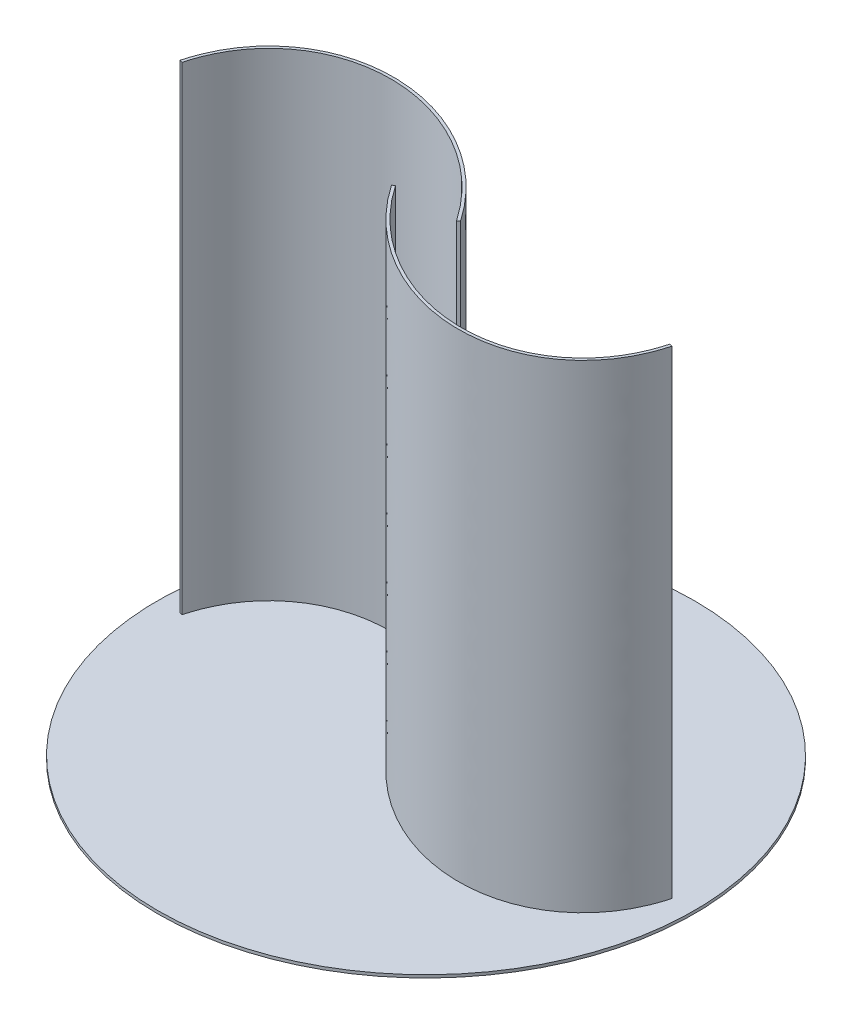
ISO-10303-21;
HEADER;
FILE_DESCRIPTION(('STEP AP214'),'2;1');
FILE_NAME('part.step','',(''),(''),'','','');
FILE_SCHEMA(('AUTOMOTIVE_DESIGN { 1 0 10303 214 1 1 1 1 }'));
ENDSEC;
DATA;
#1=APPLICATION_CONTEXT('core data for automotive mechanical design processes');
#2=APPLICATION_PROTOCOL_DEFINITION('international standard','automotive_design',2000,#1);
#3=PRODUCT_CONTEXT('',#1,'mechanical');
#4=PRODUCT('Part','Part','',(#3));
#5=PRODUCT_RELATED_PRODUCT_CATEGORY('part','',(#4));
#6=PRODUCT_DEFINITION_FORMATION('','',#4);
#7=PRODUCT_DEFINITION_CONTEXT('part definition',#1,'design');
#8=PRODUCT_DEFINITION('design','',#6,#7);
#9=PRODUCT_DEFINITION_SHAPE('','',#8);
#10=(LENGTH_UNIT() NAMED_UNIT(*) SI_UNIT(.MILLI.,.METRE.));
#11=(NAMED_UNIT(*) PLANE_ANGLE_UNIT() SI_UNIT($,.RADIAN.));
#12=(NAMED_UNIT(*) SI_UNIT($,.STERADIAN.) SOLID_ANGLE_UNIT());
#13=UNCERTAINTY_MEASURE_WITH_UNIT(LENGTH_MEASURE(1.E-05),#10,'distance_accuracy_value','');
#14=(GEOMETRIC_REPRESENTATION_CONTEXT(3) GLOBAL_UNCERTAINTY_ASSIGNED_CONTEXT((#13)) GLOBAL_UNIT_ASSIGNED_CONTEXT((#10,
#11,#12)) REPRESENTATION_CONTEXT('',''));
#15=CARTESIAN_POINT('',(0.,0.,0.));
#16=DIRECTION('',(0.,0.,1.));
#17=DIRECTION('',(1.,0.,0.));
#18=AXIS2_PLACEMENT_3D('',#15,#16,#17);
#19=CARTESIAN_POINT('',(0.,0.,0.));
#20=DIRECTION('',(0.,-1.,0.));
#21=DIRECTION('',(0.,0.,-1.));
#22=AXIS2_PLACEMENT_3D('',#19,#20,#21);
#23=PLANE('',#22);
#24=CARTESIAN_POINT('',(0.,0.,0.));
#25=DIRECTION('',(0.,-1.,0.));
#26=DIRECTION('',(0.,0.,-1.));
#27=AXIS2_PLACEMENT_3D('',#24,#25,#26);
#28=CIRCLE('',#27,280.5);
#29=CARTESIAN_POINT('',(0.,0.,-280.5));
#30=VERTEX_POINT('',#29);
#31=EDGE_CURVE('E167',#30,#30,#28,.T.);
#32=ORIENTED_EDGE('',*,*,#31,.F.);
#33=EDGE_LOOP('',(#32));
#34=FACE_BOUND('',#33,.T.);
#35=CARTESIAN_POINT('',(34.3567019278323,0.,-1.68557276360102));
#36=CARTESIAN_POINT('',(29.5180406320266,0.,-8.80962894511758));
#37=CARTESIAN_POINT('',(24.2678238614142,0.,-15.6854511547654));
#38=CARTESIAN_POINT('',(13.043122074148,0.,-28.8115258866319));
#39=CARTESIAN_POINT('',(7.06870096124442,0.,-35.0617037097251));
#40=CARTESIAN_POINT('',(-5.49220739244214,0.,-46.8186660185623));
#41=CARTESIAN_POINT('',(-12.0786234161373,0.,-52.3253840881677));
#42=CARTESIAN_POINT('',(-25.7401042447688,0.,-62.4911675497407));
#43=CARTESIAN_POINT('',(-32.8150929712779,0.,-67.1501762714525));
#44=CARTESIAN_POINT('',(-47.3213062086278,0.,-75.5316972747135));
#45=CARTESIAN_POINT('',(-54.7524526929741,0.,-79.2541631386594));
#46=CARTESIAN_POINT('',(-69.8318961120836,0.,-85.6907173548556));
#47=CARTESIAN_POINT('',(-77.4801160580006,0.,-88.4047685955086));
#48=CARTESIAN_POINT('',(-92.8502852906042,0.,-92.7708226575345));
#49=CARTESIAN_POINT('',(-100.572160633638,0.,-94.42279479753));
#50=CARTESIAN_POINT('',(-115.944153652561,0.,-96.63023356898));
#51=CARTESIAN_POINT('',(-123.594199427155,0.,-97.1856714771729));
#52=CARTESIAN_POINT('',(-138.677159660124,0.,-97.1856714771729));
#53=CARTESIAN_POINT('',(-146.10999788381,0.,-96.6302033707519));
#54=CARTESIAN_POINT('',(-160.615473740591,0.,-94.4149822007725));
#55=CARTESIAN_POINT('',(-167.688019400796,0.,-92.7552008752739));
#56=CARTESIAN_POINT('',(-181.334621666947,0.,-88.3598064115517));
#57=CARTESIAN_POINT('',(-187.908561767561,0.,-85.6241825860824));
#58=CARTESIAN_POINT('',(-200.427548629182,0.,-79.1280760902114));
#59=CARTESIAN_POINT('',(-206.372461713424,0.,-75.3676234577438));
#60=CARTESIAN_POINT('',(-217.51467821894,0.,-66.8951501946636));
#61=CARTESIAN_POINT('',(-222.71185880741,0.,-62.1832120282308));
#62=CARTESIAN_POINT('',(-232.255552380654,0.,-51.9017106473851));
#63=CARTESIAN_POINT('',(-236.601983990372,0.,-46.3322670491086));
#64=CARTESIAN_POINT('',(-244.359948454659,0.,-34.4472337790854));
#65=CARTESIAN_POINT('',(-247.77144985236,0.,-28.1317689769799));
#66=CARTESIAN_POINT('',(-253.595847097703,0.,-14.8799160218172));
#67=CARTESIAN_POINT('',(-256.008745547293,0.,-7.94363520686398));
#68=CARTESIAN_POINT('',(-257.900928695948,0.,-0.764599699857649));
#69=B_SPLINE_CURVE_WITH_KNOTS('',3,(#35,#36,#37,#38,#39,#40,#41,#42,#43,#44,#45,#46,#47,#48,#49,
#50,#51,#52,#53,#54,#55,#56,#57,#58,#59,#60,#61,#62,#63,#64,#65,#66,#67,#68),.UNSPECIFIED.,.F.,
.F.,(4,2,2,2,2,2,2,2,2,2,2,2,2,2,2,2,4),(0.,0.0625,0.125,0.1875,0.25,0.3125,0.375,0.4375,0.5,
0.5625,0.625,0.6875,0.75,0.8125,0.875,0.9375,1.),.UNSPECIFIED.);
#70=CARTESIAN_POINT('',(34.3567019278323,0.,-1.68557276360102));
#71=VERTEX_POINT('',#70);
#72=CARTESIAN_POINT('',(-257.900928695948,0.,-0.764599699857649));
#73=VERTEX_POINT('',#72);
#74=EDGE_CURVE('E221',#71,#73,#69,.T.);
#75=ORIENTED_EDGE('',*,*,#74,.F.);
#76=DIRECTION('',(-0.827233975944077,0.,0.561857587867028));
#77=VECTOR('',#76,1.);
#78=CARTESIAN_POINT('',(34.3567019278323,0.,-1.68557276360102));
#79=LINE('',#78,#77);
#80=CARTESIAN_POINT('',(31.8750000000001,0.,0.));
#81=VERTEX_POINT('',#80);
#82=EDGE_CURVE('E235',#71,#81,#79,.T.);
#83=ORIENTED_EDGE('',*,*,#82,.T.);
#84=CARTESIAN_POINT('',(-95.6588797749406,0.,76.5278398675861));
#85=DIRECTION('',(0.,1.,0.));
#86=DIRECTION('',(-0.642787609686538,0.,-0.766044443118979));
#87=AXIS2_PLACEMENT_3D('',#84,#85,#86);
#88=ELLIPSE('',#87,185.,148.072291028999);
#89=CARTESIAN_POINT('',(-255.,0.,0.));
#90=VERTEX_POINT('',#89);
#91=EDGE_CURVE('E232',#81,#90,#88,.T.);
#92=ORIENTED_EDGE('',*,*,#91,.T.);
#93=DIRECTION('',(-0.966976231982835,0.,-0.254866566619239));
#94=VECTOR('',#93,1.);
#95=CARTESIAN_POINT('',(-255.,0.,0.));
#96=LINE('',#95,#94);
#97=EDGE_CURVE('E225',#90,#73,#96,.T.);
#98=ORIENTED_EDGE('',*,*,#97,.T.);
#99=EDGE_LOOP('',(#75,#83,#92,#98));
#100=FACE_BOUND('',#99,.T.);
#101=CARTESIAN_POINT('',(-34.3567019278323,0.,1.68557276360107));
#102=CARTESIAN_POINT('',(-29.5180406320266,0.,8.80962894511763));
#103=CARTESIAN_POINT('',(-24.2678238614141,0.,15.6854511547655));
#104=CARTESIAN_POINT('',(-13.0431220741479,0.,28.811525886632));
#105=CARTESIAN_POINT('',(-7.06870096124435,0.,35.0617037097251));
#106=CARTESIAN_POINT('',(5.49220739244221,0.,46.8186660185623));
#107=CARTESIAN_POINT('',(12.0786234161373,0.,52.3253840881677));
#108=CARTESIAN_POINT('',(25.7401042447688,0.,62.4911675497407));
#109=CARTESIAN_POINT('',(32.8150929712779,0.,67.1501762714525));
#110=CARTESIAN_POINT('',(47.3213062086279,0.,75.5316972747135));
#111=CARTESIAN_POINT('',(54.7524526929742,0.,79.2541631386594));
#112=CARTESIAN_POINT('',(69.8318961120837,0.,85.6907173548555));
#113=CARTESIAN_POINT('',(77.4801160580007,0.,88.4047685955086));
#114=CARTESIAN_POINT('',(92.8502852906043,0.,92.7708226575345));
#115=CARTESIAN_POINT('',(100.572160633638,0.,94.4227947975299));
#116=CARTESIAN_POINT('',(115.944153652561,0.,96.63023356898));
#117=CARTESIAN_POINT('',(123.594199427155,0.,97.1856714771729));
#118=CARTESIAN_POINT('',(138.677159660125,0.,97.1856714771729));
#119=CARTESIAN_POINT('',(146.10999788381,0.,96.6302033707519));
#120=CARTESIAN_POINT('',(160.615473740591,0.,94.4149822007725));
#121=CARTESIAN_POINT('',(167.688019400796,0.,92.7552008752738));
#122=CARTESIAN_POINT('',(181.334621666947,0.,88.3598064115516));
#123=CARTESIAN_POINT('',(187.908561767561,0.,85.6241825860823));
#124=CARTESIAN_POINT('',(200.427548629183,0.,79.1280760902113));
#125=CARTESIAN_POINT('',(206.372461713424,0.,75.3676234577438));
#126=CARTESIAN_POINT('',(217.51467821894,0.,66.8951501946635));
#127=CARTESIAN_POINT('',(222.71185880741,0.,62.1832120282307));
#128=CARTESIAN_POINT('',(232.255552380655,0.,51.901710647385));
#129=CARTESIAN_POINT('',(236.601983990372,0.,46.3322670491085));
#130=CARTESIAN_POINT('',(244.359948454659,0.,34.4472337790853));
#131=CARTESIAN_POINT('',(247.77144985236,0.,28.1317689769798));
#132=CARTESIAN_POINT('',(253.595847097703,0.,14.8799160218171));
#133=CARTESIAN_POINT('',(256.008745547293,0.,7.94363520686391));
#134=CARTESIAN_POINT('',(257.900928695949,0.,0.764599699857468));
#135=B_SPLINE_CURVE_WITH_KNOTS('',3,(#101,#102,#103,#104,#105,#106,#107,#108,#109,#110,#111,
#112,#113,#114,#115,#116,#117,#118,#119,#120,#121,#122,#123,#124,#125,#126,#127,#128,#129,#130,
#131,#132,#133,#134),.UNSPECIFIED.,.F.,.F.,(4,2,2,2,2,2,2,2,2,2,2,2,2,2,2,2,4),(0.,
0.0624999999999998,0.125,0.187499999999999,0.249999999999999,0.312499999999999,
0.374999999999999,0.437499999999999,0.499999999999999,0.562499999999999,0.624999999999999,
0.687499999999999,0.749999999999999,0.8125,0.875,0.9375,1.),.UNSPECIFIED.);
#136=CARTESIAN_POINT('',(-34.3567019278323,0.,1.68557276360107));
#137=VERTEX_POINT('',#136);
#138=CARTESIAN_POINT('',(257.900928695948,0.,0.764599699857565));
#139=VERTEX_POINT('',#138);
#140=EDGE_CURVE('E163',#137,#139,#135,.T.);
#141=ORIENTED_EDGE('',*,*,#140,.F.);
#142=DIRECTION('',(0.827233975944077,0.,-0.561857587867028));
#143=VECTOR('',#142,1.);
#144=CARTESIAN_POINT('',(-34.3567019278323,0.,1.68557276360107));
#145=LINE('',#144,#143);
#146=CARTESIAN_POINT('',(-31.875,0.,0.));
#147=VERTEX_POINT('',#146);
#148=EDGE_CURVE('E157',#137,#147,#145,.T.);
#149=ORIENTED_EDGE('',*,*,#148,.T.);
#150=CARTESIAN_POINT('',(95.6588797749406,0.,-76.5278398675861));
#151=DIRECTION('',(0.,1.,0.));
#152=DIRECTION('',(0.642787609686538,0.,0.766044443118979));
#153=AXIS2_PLACEMENT_3D('',#150,#151,#152);
#154=ELLIPSE('',#153,185.,148.072291028999);
#155=CARTESIAN_POINT('',(255.,0.,-1.52655665885959E-13));
#156=VERTEX_POINT('',#155);
#157=EDGE_CURVE('E89',#147,#156,#154,.T.);
#158=ORIENTED_EDGE('',*,*,#157,.T.);
#159=DIRECTION('',(0.966976231982835,0.,0.254866566619238));
#160=VECTOR('',#159,1.);
#161=CARTESIAN_POINT('',(255.,0.,-1.52655665885959E-13));
#162=LINE('',#161,#160);
#163=EDGE_CURVE('E267',#156,#139,#162,.T.);
#164=ORIENTED_EDGE('',*,*,#163,.T.);
#165=EDGE_LOOP('',(#141,#149,#158,#164));
#166=FACE_BOUND('',#165,.T.);
#167=ADVANCED_FACE('F73',(#34,#100,#166),#23,.F.);
#168=CARTESIAN_POINT('',(34.3567019278323,500.,-1.68557276360102));
#169=CARTESIAN_POINT('',(29.5180406320266,500.,-8.80962894511758));
#170=CARTESIAN_POINT('',(24.2678238614142,500.,-15.6854511547654));
#171=CARTESIAN_POINT('',(13.043122074148,500.,-28.8115258866319));
#172=CARTESIAN_POINT('',(7.06870096124442,500.,-35.0617037097251));
#173=CARTESIAN_POINT('',(-5.49220739244214,500.,-46.8186660185623));
#174=CARTESIAN_POINT('',(-12.0786234161373,500.,-52.3253840881677));
#175=CARTESIAN_POINT('',(-25.7401042447688,500.,-62.4911675497407));
#176=CARTESIAN_POINT('',(-32.8150929712779,500.,-67.1501762714525));
#177=CARTESIAN_POINT('',(-47.3213062086278,500.,-75.5316972747135));
#178=CARTESIAN_POINT('',(-54.7524526929741,500.,-79.2541631386594));
#179=CARTESIAN_POINT('',(-69.8318961120836,500.,-85.6907173548556));
#180=CARTESIAN_POINT('',(-77.4801160580006,500.,-88.4047685955086));
#181=CARTESIAN_POINT('',(-92.8502852906042,500.,-92.7708226575345));
#182=CARTESIAN_POINT('',(-100.572160633638,500.,-94.42279479753));
#183=CARTESIAN_POINT('',(-115.944153652561,500.,-96.63023356898));
#184=CARTESIAN_POINT('',(-123.594199427155,500.,-97.1856714771729));
#185=CARTESIAN_POINT('',(-138.677159660124,500.,-97.1856714771729));
#186=CARTESIAN_POINT('',(-146.10999788381,500.,-96.6302033707519));
#187=CARTESIAN_POINT('',(-160.615473740591,500.,-94.4149822007725));
#188=CARTESIAN_POINT('',(-167.688019400796,500.,-92.7552008752739));
#189=CARTESIAN_POINT('',(-181.334621666947,500.,-88.3598064115517));
#190=CARTESIAN_POINT('',(-187.908561767561,500.,-85.6241825860824));
#191=CARTESIAN_POINT('',(-200.427548629182,500.,-79.1280760902114));
#192=CARTESIAN_POINT('',(-206.372461713424,500.,-75.3676234577438));
#193=CARTESIAN_POINT('',(-217.51467821894,500.,-66.8951501946636));
#194=CARTESIAN_POINT('',(-222.71185880741,500.,-62.1832120282308));
#195=CARTESIAN_POINT('',(-232.255552380654,500.,-51.9017106473851));
#196=CARTESIAN_POINT('',(-236.601983990372,500.,-46.3322670491086));
#197=CARTESIAN_POINT('',(-244.359948454659,500.,-34.4472337790854));
#198=CARTESIAN_POINT('',(-247.77144985236,500.,-28.1317689769799));
#199=CARTESIAN_POINT('',(-253.595847097703,500.,-14.8799160218172));
#200=CARTESIAN_POINT('',(-256.008745547293,500.,-7.94363520686398));
#201=CARTESIAN_POINT('',(-257.900928695948,500.,-0.764599699857649));
#202=B_SPLINE_CURVE_WITH_KNOTS('',3,(#168,#169,#170,#171,#172,#173,#174,#175,#176,#177,#178,
#179,#180,#181,#182,#183,#184,#185,#186,#187,#188,#189,#190,#191,#192,#193,#194,#195,#196,#197,
#198,#199,#200,#201),.UNSPECIFIED.,.F.,.F.,(4,2,2,2,2,2,2,2,2,2,2,2,2,2,2,2,4),(0.,0.0625,0.125,
0.1875,0.25,0.3125,0.375,0.4375,0.5,0.5625,0.625,0.6875,0.75,0.8125,0.875,0.9375,1.),.UNSPECIFIED.);
#203=DIRECTION('',(0.,-1.,0.));
#204=VECTOR('',#203,1.);
#205=SURFACE_OF_LINEAR_EXTRUSION('',#202,#204);
#206=ORIENTED_EDGE('',*,*,#74,.T.);
#207=DIRECTION('',(0.,-1.,0.));
#208=VECTOR('',#207,1.);
#209=CARTESIAN_POINT('',(-257.900928695948,500.,-0.764599699857649));
#210=LINE('',#209,#208);
#211=CARTESIAN_POINT('',(-257.900928695948,500.,-0.764599699857649));
#212=VERTEX_POINT('',#211);
#213=EDGE_CURVE('E12',#212,#73,#210,.T.);
#214=ORIENTED_EDGE('',*,*,#213,.F.);
#215=CARTESIAN_POINT('',(34.3567019278323,500.,-1.68557276360102));
#216=VERTEX_POINT('',#215);
#217=EDGE_CURVE('E120',#216,#212,#202,.T.);
#218=ORIENTED_EDGE('',*,*,#217,.F.);
#219=DIRECTION('',(0.,-1.,0.));
#220=VECTOR('',#219,1.);
#221=CARTESIAN_POINT('',(34.3567019278323,500.,-1.68557276360102));
#222=LINE('',#221,#220);
#223=EDGE_CURVE('E98',#216,#71,#222,.T.);
#224=ORIENTED_EDGE('',*,*,#223,.T.);
#225=EDGE_LOOP('',(#206,#214,#218,#224));
#226=FACE_BOUND('',#225,.T.);
#227=ADVANCED_FACE('F75',(#226),#205,.F.);
#228=CARTESIAN_POINT('',(-255.,500.,0.));
#229=DIRECTION('',(-0.254866566619239,0.,0.966976231982835));
#230=DIRECTION('',(0.966976231982835,0.,0.254866566619239));
#231=AXIS2_PLACEMENT_3D('',#228,#229,#230);
#232=PLANE('',#231);
#233=ORIENTED_EDGE('',*,*,#97,.F.);
#234=DIRECTION('',(0.,-1.,0.));
#235=VECTOR('',#234,1.);
#236=CARTESIAN_POINT('',(-255.,500.,0.));
#237=LINE('',#236,#235);
#238=CARTESIAN_POINT('',(-255.,500.,0.));
#239=VERTEX_POINT('',#238);
#240=EDGE_CURVE('E82',#239,#90,#237,.T.);
#241=ORIENTED_EDGE('',*,*,#240,.F.);
#242=DIRECTION('',(-0.966976231982835,0.,-0.254866566619239));
#243=VECTOR('',#242,1.);
#244=CARTESIAN_POINT('',(-255.,500.,0.));
#245=LINE('',#244,#243);
#246=EDGE_CURVE('E219',#239,#212,#245,.T.);
#247=ORIENTED_EDGE('',*,*,#246,.T.);
#248=ORIENTED_EDGE('',*,*,#213,.T.);
#249=EDGE_LOOP('',(#233,#241,#247,#248));
#250=FACE_BOUND('',#249,.T.);
#251=ADVANCED_FACE('F211',(#250),#232,.T.);
#252=CARTESIAN_POINT('',(-95.6588797749406,500.,76.5278398675861));
#253=DIRECTION('',(0.,1.,0.));
#254=DIRECTION('',(-0.642787609686538,0.,-0.766044443118979));
#255=AXIS2_PLACEMENT_3D('',#252,#253,#254);
#256=ELLIPSE('',#255,185.,148.072291028999);
#257=DIRECTION('',(0.,-1.,0.));
#258=VECTOR('',#257,1.);
#259=SURFACE_OF_LINEAR_EXTRUSION('',#256,#258);
#260=ORIENTED_EDGE('',*,*,#91,.F.);
#261=DIRECTION('',(0.,-1.,0.));
#262=VECTOR('',#261,1.);
#263=CARTESIAN_POINT('',(31.8750000000001,500.,0.));
#264=LINE('',#263,#262);
#265=CARTESIAN_POINT('',(31.8750000000001,500.,0.));
#266=VERTEX_POINT('',#265);
#267=EDGE_CURVE('E239',#266,#81,#264,.T.);
#268=ORIENTED_EDGE('',*,*,#267,.F.);
#269=EDGE_CURVE('E213',#266,#239,#256,.T.);
#270=ORIENTED_EDGE('',*,*,#269,.T.);
#271=ORIENTED_EDGE('',*,*,#240,.T.);
#272=EDGE_LOOP('',(#260,#268,#270,#271));
#273=FACE_BOUND('',#272,.T.);
#274=ADVANCED_FACE('F208',(#273),#259,.T.);
#275=CARTESIAN_POINT('',(34.3567019278323,500.,-1.68557276360102));
#276=DIRECTION('',(0.561857587867028,0.,0.827233975944077));
#277=DIRECTION('',(0.827233975944077,0.,-0.561857587867028));
#278=AXIS2_PLACEMENT_3D('',#275,#276,#277);
#279=PLANE('',#278);
#280=ORIENTED_EDGE('',*,*,#82,.F.);
#281=ORIENTED_EDGE('',*,*,#223,.F.);
#282=DIRECTION('',(-0.827233975944077,0.,0.561857587867028));
#283=VECTOR('',#282,1.);
#284=CARTESIAN_POINT('',(34.3567019278323,500.,-1.68557276360102));
#285=LINE('',#284,#283);
#286=EDGE_CURVE('E218',#216,#266,#285,.T.);
#287=ORIENTED_EDGE('',*,*,#286,.T.);
#288=ORIENTED_EDGE('',*,*,#267,.T.);
#289=EDGE_LOOP('',(#280,#281,#287,#288));
#290=FACE_BOUND('',#289,.T.);
#291=ADVANCED_FACE('F205',(#290),#279,.T.);
#292=CARTESIAN_POINT('',(-131.13567954364,500.,-97.185671477173));
#293=DIRECTION('',(0.,-1.,0.));
#294=DIRECTION('',(-1.,0.,0.));
#295=AXIS2_PLACEMENT_3D('',#292,#293,#294);
#296=PLANE('',#295);
#297=ORIENTED_EDGE('',*,*,#217,.T.);
#298=ORIENTED_EDGE('',*,*,#246,.F.);
#299=ORIENTED_EDGE('',*,*,#269,.F.);
#300=ORIENTED_EDGE('',*,*,#286,.F.);
#301=EDGE_LOOP('',(#297,#298,#299,#300));
#302=FACE_BOUND('',#301,.T.);
#303=ADVANCED_FACE('F201',(#302),#296,.F.);
#304=CARTESIAN_POINT('',(0.,-3.,0.));
#305=DIRECTION('',(0.,1.,0.));
#306=DIRECTION('',(0.,0.,1.));
#307=AXIS2_PLACEMENT_3D('',#304,#305,#306);
#308=CYLINDRICAL_SURFACE('',#307,280.5);
#309=CARTESIAN_POINT('',(0.,-3.,0.));
#310=DIRECTION('',(0.,-1.,0.));
#311=DIRECTION('',(0.,0.,-1.));
#312=AXIS2_PLACEMENT_3D('',#309,#310,#311);
#313=CIRCLE('',#312,280.5);
#314=CARTESIAN_POINT('',(0.,-3.,-280.5));
#315=VERTEX_POINT('',#314);
#316=EDGE_CURVE('E226',#315,#315,#313,.T.);
#317=ORIENTED_EDGE('',*,*,#316,.F.);
#318=EDGE_LOOP('',(#317));
#319=FACE_BOUND('',#318,.T.);
#320=ORIENTED_EDGE('',*,*,#31,.T.);
#321=EDGE_LOOP('',(#320));
#322=FACE_BOUND('',#321,.T.);
#323=ADVANCED_FACE('F194',(#319,#322),#308,.T.);
#324=CARTESIAN_POINT('',(0.,-3.,0.));
#325=DIRECTION('',(0.,-1.,0.));
#326=DIRECTION('',(0.,0.,-1.));
#327=AXIS2_PLACEMENT_3D('',#324,#325,#326);
#328=PLANE('',#327);
#329=ORIENTED_EDGE('',*,*,#316,.T.);
#330=EDGE_LOOP('',(#329));
#331=FACE_BOUND('',#330,.T.);
#332=ADVANCED_FACE('F191',(#331),#328,.T.);
#333=CARTESIAN_POINT('',(-34.3567019278323,500.,1.68557276360107));
#334=CARTESIAN_POINT('',(-29.5180406320266,500.,8.80962894511763));
#335=CARTESIAN_POINT('',(-24.2678238614141,500.,15.6854511547655));
#336=CARTESIAN_POINT('',(-13.0431220741479,500.,28.811525886632));
#337=CARTESIAN_POINT('',(-7.06870096124435,500.,35.0617037097251));
#338=CARTESIAN_POINT('',(5.49220739244221,500.,46.8186660185623));
#339=CARTESIAN_POINT('',(12.0786234161373,500.,52.3253840881677));
#340=CARTESIAN_POINT('',(25.7401042447688,500.,62.4911675497407));
#341=CARTESIAN_POINT('',(32.8150929712779,500.,67.1501762714525));
#342=CARTESIAN_POINT('',(47.3213062086279,500.,75.5316972747135));
#343=CARTESIAN_POINT('',(54.7524526929742,500.,79.2541631386594));
#344=CARTESIAN_POINT('',(69.8318961120837,500.,85.6907173548555));
#345=CARTESIAN_POINT('',(77.4801160580007,500.,88.4047685955086));
#346=CARTESIAN_POINT('',(92.8502852906043,500.,92.7708226575345));
#347=CARTESIAN_POINT('',(100.572160633638,500.,94.4227947975299));
#348=CARTESIAN_POINT('',(115.944153652561,500.,96.63023356898));
#349=CARTESIAN_POINT('',(123.594199427155,500.,97.1856714771729));
#350=CARTESIAN_POINT('',(138.677159660125,500.,97.1856714771729));
#351=CARTESIAN_POINT('',(146.10999788381,500.,96.6302033707519));
#352=CARTESIAN_POINT('',(160.615473740591,500.,94.4149822007725));
#353=CARTESIAN_POINT('',(167.688019400796,500.,92.7552008752738));
#354=CARTESIAN_POINT('',(181.334621666947,500.,88.3598064115516));
#355=CARTESIAN_POINT('',(187.908561767561,500.,85.6241825860823));
#356=CARTESIAN_POINT('',(200.427548629183,500.,79.1280760902113));
#357=CARTESIAN_POINT('',(206.372461713424,500.,75.3676234577438));
#358=CARTESIAN_POINT('',(217.51467821894,500.,66.8951501946635));
#359=CARTESIAN_POINT('',(222.71185880741,500.,62.1832120282307));
#360=CARTESIAN_POINT('',(232.255552380655,500.,51.901710647385));
#361=CARTESIAN_POINT('',(236.601983990372,500.,46.3322670491085));
#362=CARTESIAN_POINT('',(244.359948454659,500.,34.4472337790853));
#363=CARTESIAN_POINT('',(247.77144985236,500.,28.1317689769798));
#364=CARTESIAN_POINT('',(253.595847097703,500.,14.8799160218171));
#365=CARTESIAN_POINT('',(256.008745547293,500.,7.94363520686391));
#366=CARTESIAN_POINT('',(257.900928695949,500.,0.764599699857468));
#367=B_SPLINE_CURVE_WITH_KNOTS('',3,(#333,#334,#335,#336,#337,#338,#339,#340,#341,#342,#343,
#344,#345,#346,#347,#348,#349,#350,#351,#352,#353,#354,#355,#356,#357,#358,#359,#360,#361,#362,
#363,#364,#365,#366),.UNSPECIFIED.,.F.,.F.,(4,2,2,2,2,2,2,2,2,2,2,2,2,2,2,2,4),(0.,
0.0624999999999998,0.125,0.187499999999999,0.249999999999999,0.312499999999999,
0.374999999999999,0.437499999999999,0.499999999999999,0.562499999999999,0.624999999999999,
0.687499999999999,0.749999999999999,0.8125,0.875,0.9375,1.),.UNSPECIFIED.);
#368=DIRECTION('',(0.,-1.,0.));
#369=VECTOR('',#368,1.);
#370=SURFACE_OF_LINEAR_EXTRUSION('',#367,#369);
#371=ORIENTED_EDGE('',*,*,#140,.T.);
#372=DIRECTION('',(0.,-1.,0.));
#373=VECTOR('',#372,1.);
#374=CARTESIAN_POINT('',(257.900928695948,500.,0.764599699857565));
#375=LINE('',#374,#373);
#376=CARTESIAN_POINT('',(257.900928695948,500.,0.764599699857565));
#377=VERTEX_POINT('',#376);
#378=EDGE_CURVE('E160',#377,#139,#375,.T.);
#379=ORIENTED_EDGE('',*,*,#378,.F.);
#380=CARTESIAN_POINT('',(-34.3567019278323,500.,1.68557276360107));
#381=VERTEX_POINT('',#380);
#382=EDGE_CURVE('E147',#381,#377,#367,.T.);
#383=ORIENTED_EDGE('',*,*,#382,.F.);
#384=DIRECTION('',(0.,-1.,0.));
#385=VECTOR('',#384,1.);
#386=CARTESIAN_POINT('',(-34.3567019278323,500.,1.68557276360107));
#387=LINE('',#386,#385);
#388=EDGE_CURVE('E262',#381,#137,#387,.T.);
#389=ORIENTED_EDGE('',*,*,#388,.T.);
#390=EDGE_LOOP('',(#371,#379,#383,#389));
#391=FACE_BOUND('',#390,.T.);
#392=ADVANCED_FACE('F161',(#391),#370,.F.);
#393=CARTESIAN_POINT('',(255.,500.,-1.52655665885959E-13));
#394=DIRECTION('',(0.254866566619238,0.,-0.966976231982835));
#395=DIRECTION('',(-0.966976231982835,0.,-0.254866566619238));
#396=AXIS2_PLACEMENT_3D('',#393,#394,#395);
#397=PLANE('',#396);
#398=ORIENTED_EDGE('',*,*,#163,.F.);
#399=DIRECTION('',(0.,-1.,0.));
#400=VECTOR('',#399,1.);
#401=CARTESIAN_POINT('',(255.,500.,-1.52655665885959E-13));
#402=LINE('',#401,#400);
#403=CARTESIAN_POINT('',(255.,500.,-1.52655665885959E-13));
#404=VERTEX_POINT('',#403);
#405=EDGE_CURVE('E168',#404,#156,#402,.T.);
#406=ORIENTED_EDGE('',*,*,#405,.F.);
#407=DIRECTION('',(0.966976231982835,0.,0.254866566619238));
#408=VECTOR('',#407,1.);
#409=CARTESIAN_POINT('',(255.,500.,-1.52655665885959E-13));
#410=LINE('',#409,#408);
#411=EDGE_CURVE('E152',#404,#377,#410,.T.);
#412=ORIENTED_EDGE('',*,*,#411,.T.);
#413=ORIENTED_EDGE('',*,*,#378,.T.);
#414=EDGE_LOOP('',(#398,#406,#412,#413));
#415=FACE_BOUND('',#414,.T.);
#416=ADVANCED_FACE('F170',(#415),#397,.T.);
#417=CARTESIAN_POINT('',(95.6588797749406,500.,-76.5278398675861));
#418=DIRECTION('',(0.,1.,0.));
#419=DIRECTION('',(0.642787609686538,0.,0.766044443118979));
#420=AXIS2_PLACEMENT_3D('',#417,#418,#419);
#421=ELLIPSE('',#420,185.,148.072291028999);
#422=DIRECTION('',(0.,-1.,0.));
#423=VECTOR('',#422,1.);
#424=SURFACE_OF_LINEAR_EXTRUSION('',#421,#423);
#425=ORIENTED_EDGE('',*,*,#157,.F.);
#426=DIRECTION('',(0.,-1.,0.));
#427=VECTOR('',#426,1.);
#428=CARTESIAN_POINT('',(-31.875,500.,0.));
#429=LINE('',#428,#427);
#430=CARTESIAN_POINT('',(-31.875,500.,0.));
#431=VERTEX_POINT('',#430);
#432=EDGE_CURVE('E260',#431,#147,#429,.T.);
#433=ORIENTED_EDGE('',*,*,#432,.F.);
#434=EDGE_CURVE('E171',#431,#404,#421,.T.);
#435=ORIENTED_EDGE('',*,*,#434,.T.);
#436=ORIENTED_EDGE('',*,*,#405,.T.);
#437=EDGE_LOOP('',(#425,#433,#435,#436));
#438=FACE_BOUND('',#437,.T.);
#439=ADVANCED_FACE('F181',(#438),#424,.T.);
#440=CARTESIAN_POINT('',(-34.3567019278323,500.,1.68557276360107));
#441=DIRECTION('',(-0.561857587867028,0.,-0.827233975944077));
#442=DIRECTION('',(-0.827233975944077,0.,0.561857587867028));
#443=AXIS2_PLACEMENT_3D('',#440,#441,#442);
#444=PLANE('',#443);
#445=ORIENTED_EDGE('',*,*,#148,.F.);
#446=ORIENTED_EDGE('',*,*,#388,.F.);
#447=DIRECTION('',(0.827233975944077,0.,-0.561857587867028));
#448=VECTOR('',#447,1.);
#449=CARTESIAN_POINT('',(-34.3567019278323,500.,1.68557276360107));
#450=LINE('',#449,#448);
#451=EDGE_CURVE('E155',#381,#431,#450,.T.);
#452=ORIENTED_EDGE('',*,*,#451,.T.);
#453=ORIENTED_EDGE('',*,*,#432,.T.);
#454=EDGE_LOOP('',(#445,#446,#452,#453));
#455=FACE_BOUND('',#454,.T.);
#456=ADVANCED_FACE('F185',(#455),#444,.T.);
#457=CARTESIAN_POINT('',(131.13567954364,500.,97.1856714771729));
#458=DIRECTION('',(0.,-1.,0.));
#459=DIRECTION('',(-1.,0.,0.));
#460=AXIS2_PLACEMENT_3D('',#457,#458,#459);
#461=PLANE('',#460);
#462=ORIENTED_EDGE('',*,*,#382,.T.);
#463=ORIENTED_EDGE('',*,*,#411,.F.);
#464=ORIENTED_EDGE('',*,*,#434,.F.);
#465=ORIENTED_EDGE('',*,*,#451,.F.);
#466=EDGE_LOOP('',(#462,#463,#464,#465));
#467=FACE_BOUND('',#466,.T.);
#468=ADVANCED_FACE('F149',(#467),#461,.F.);
#469=CLOSED_SHELL('',(#167,#227,#251,#274,#291,#303,#323,#332,#392,#416,#439,#456,#468));
#470=MANIFOLD_SOLID_BREP('B2',#469);
#471=ADVANCED_BREP_SHAPE_REPRESENTATION('',(#18,#470),#14);
#472=SHAPE_DEFINITION_REPRESENTATION(#9,#471);
ENDSEC;
END-ISO-10303-21;
